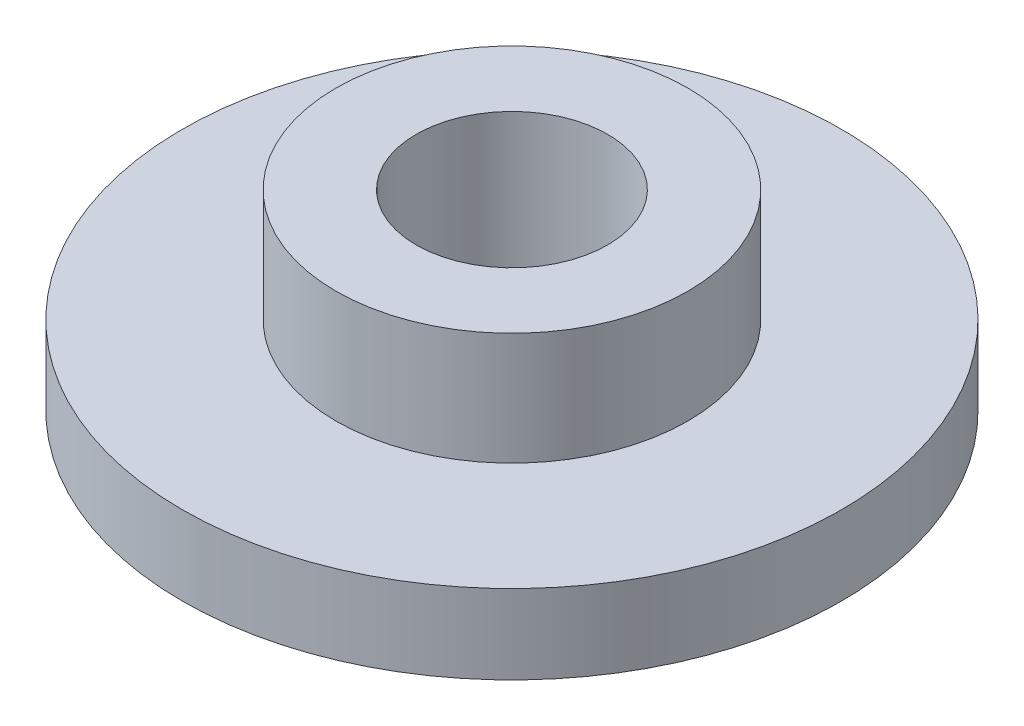
ISO-10303-21;
HEADER;
FILE_DESCRIPTION(('STEP AP214'),'2;1');
FILE_NAME('part.step','',(''),(''),'','','');
FILE_SCHEMA(('AUTOMOTIVE_DESIGN { 1 0 10303 214 1 1 1 1 }'));
ENDSEC;
DATA;
#1=APPLICATION_CONTEXT('core data for automotive mechanical design processes');
#2=APPLICATION_PROTOCOL_DEFINITION('international standard','automotive_design',2000,#1);
#3=PRODUCT_CONTEXT('',#1,'mechanical');
#4=PRODUCT('Part','Part','',(#3));
#5=PRODUCT_RELATED_PRODUCT_CATEGORY('part','',(#4));
#6=PRODUCT_DEFINITION_FORMATION('','',#4);
#7=PRODUCT_DEFINITION_CONTEXT('part definition',#1,'design');
#8=PRODUCT_DEFINITION('design','',#6,#7);
#9=PRODUCT_DEFINITION_SHAPE('','',#8);
#10=(LENGTH_UNIT() NAMED_UNIT(*) SI_UNIT(.MILLI.,.METRE.));
#11=(NAMED_UNIT(*) PLANE_ANGLE_UNIT() SI_UNIT($,.RADIAN.));
#12=(NAMED_UNIT(*) SI_UNIT($,.STERADIAN.) SOLID_ANGLE_UNIT());
#13=UNCERTAINTY_MEASURE_WITH_UNIT(LENGTH_MEASURE(1.E-05),#10,'distance_accuracy_value','');
#14=(GEOMETRIC_REPRESENTATION_CONTEXT(3) GLOBAL_UNCERTAINTY_ASSIGNED_CONTEXT((#13)) GLOBAL_UNIT_ASSIGNED_CONTEXT((#10,
#11,#12)) REPRESENTATION_CONTEXT('',''));
#15=CARTESIAN_POINT('',(0.,0.,0.));
#16=DIRECTION('',(0.,0.,1.));
#17=DIRECTION('',(1.,0.,0.));
#18=AXIS2_PLACEMENT_3D('',#15,#16,#17);
#19=CARTESIAN_POINT('',(0.,0.,0.));
#20=DIRECTION('',(0.,1.,0.));
#21=DIRECTION('',(0.,0.,1.));
#22=AXIS2_PLACEMENT_3D('',#19,#20,#21);
#23=CYLINDRICAL_SURFACE('',#22,4.);
#24=CARTESIAN_POINT('',(0.,8.,0.));
#25=DIRECTION('',(0.,1.,0.));
#26=DIRECTION('',(0.,0.,1.));
#27=AXIS2_PLACEMENT_3D('',#24,#25,#26);
#28=CIRCLE('',#27,4.);
#29=CARTESIAN_POINT('',(0.,8.,4.));
#30=VERTEX_POINT('',#29);
#31=EDGE_CURVE('E10',#30,#30,#28,.T.);
#32=ORIENTED_EDGE('',*,*,#31,.T.);
#33=EDGE_LOOP('',(#32));
#34=FACE_BOUND('',#33,.T.);
#35=CARTESIAN_POINT('',(0.,0.,0.));
#36=DIRECTION('',(0.,1.,0.));
#37=DIRECTION('',(0.,0.,1.));
#38=AXIS2_PLACEMENT_3D('',#35,#36,#37);
#39=CIRCLE('',#38,4.);
#40=CARTESIAN_POINT('',(0.,0.,4.));
#41=VERTEX_POINT('',#40);
#42=EDGE_CURVE('E64',#41,#41,#39,.T.);
#43=ORIENTED_EDGE('',*,*,#42,.F.);
#44=EDGE_LOOP('',(#43));
#45=FACE_BOUND('',#44,.T.);
#46=ADVANCED_FACE('F37',(#34,#45),#23,.F.);
#47=CARTESIAN_POINT('',(-4.,8.,0.));
#48=DIRECTION('',(0.,1.,0.));
#49=DIRECTION('',(0.,0.,1.));
#50=AXIS2_PLACEMENT_3D('',#47,#48,#49);
#51=PLANE('',#50);
#52=CARTESIAN_POINT('',(0.,8.,0.));
#53=DIRECTION('',(0.,1.,0.));
#54=DIRECTION('',(0.,0.,1.));
#55=AXIS2_PLACEMENT_3D('',#52,#53,#54);
#56=CIRCLE('',#55,7.34637867356438);
#57=CARTESIAN_POINT('',(0.,8.,7.34637867356438));
#58=VERTEX_POINT('',#57);
#59=EDGE_CURVE('E44',#58,#58,#56,.T.);
#60=ORIENTED_EDGE('',*,*,#59,.T.);
#61=EDGE_LOOP('',(#60));
#62=FACE_BOUND('',#61,.T.);
#63=ORIENTED_EDGE('',*,*,#31,.F.);
#64=EDGE_LOOP('',(#63));
#65=FACE_BOUND('',#64,.T.);
#66=ADVANCED_FACE('F73',(#62,#65),#51,.T.);
#67=CARTESIAN_POINT('',(0.,0.,0.));
#68=DIRECTION('',(0.,1.,0.));
#69=DIRECTION('',(0.,0.,1.));
#70=AXIS2_PLACEMENT_3D('',#67,#68,#69);
#71=CYLINDRICAL_SURFACE('',#70,7.34637867356438);
#72=CARTESIAN_POINT('',(0.,3.30453955227927,0.));
#73=DIRECTION('',(0.,1.,0.));
#74=DIRECTION('',(0.,0.,1.));
#75=AXIS2_PLACEMENT_3D('',#72,#73,#74);
#76=CIRCLE('',#75,7.34637867356438);
#77=CARTESIAN_POINT('',(0.,3.30453955227927,7.34637867356438));
#78=VERTEX_POINT('',#77);
#79=EDGE_CURVE('E49',#78,#78,#76,.T.);
#80=ORIENTED_EDGE('',*,*,#79,.T.);
#81=EDGE_LOOP('',(#80));
#82=FACE_BOUND('',#81,.T.);
#83=ORIENTED_EDGE('',*,*,#59,.F.);
#84=EDGE_LOOP('',(#83));
#85=FACE_BOUND('',#84,.T.);
#86=ADVANCED_FACE('F77',(#82,#85),#71,.T.);
#87=CARTESIAN_POINT('',(-13.7594166261057,3.30453955227927,0.));
#88=DIRECTION('',(0.,1.,0.));
#89=DIRECTION('',(0.,0.,1.));
#90=AXIS2_PLACEMENT_3D('',#87,#88,#89);
#91=PLANE('',#90);
#92=CARTESIAN_POINT('',(0.,3.30453955227927,0.));
#93=DIRECTION('',(0.,1.,0.));
#94=DIRECTION('',(0.,0.,1.));
#95=AXIS2_PLACEMENT_3D('',#92,#93,#94);
#96=CIRCLE('',#95,13.7594166261057);
#97=CARTESIAN_POINT('',(0.,3.30453955227927,13.7594166261057));
#98=VERTEX_POINT('',#97);
#99=EDGE_CURVE('E54',#98,#98,#96,.T.);
#100=ORIENTED_EDGE('',*,*,#99,.T.);
#101=EDGE_LOOP('',(#100));
#102=FACE_BOUND('',#101,.T.);
#103=ORIENTED_EDGE('',*,*,#79,.F.);
#104=EDGE_LOOP('',(#103));
#105=FACE_BOUND('',#104,.T.);
#106=ADVANCED_FACE('F81',(#102,#105),#91,.T.);
#107=CARTESIAN_POINT('',(0.,0.,0.));
#108=DIRECTION('',(0.,1.,0.));
#109=DIRECTION('',(0.,0.,1.));
#110=AXIS2_PLACEMENT_3D('',#107,#108,#109);
#111=CYLINDRICAL_SURFACE('',#110,13.7594166261057);
#112=CARTESIAN_POINT('',(0.,0.,0.));
#113=DIRECTION('',(0.,1.,0.));
#114=DIRECTION('',(0.,0.,1.));
#115=AXIS2_PLACEMENT_3D('',#112,#113,#114);
#116=CIRCLE('',#115,13.7594166261057);
#117=CARTESIAN_POINT('',(0.,0.,13.7594166261057));
#118=VERTEX_POINT('',#117);
#119=EDGE_CURVE('E60',#118,#118,#116,.T.);
#120=ORIENTED_EDGE('',*,*,#119,.T.);
#121=EDGE_LOOP('',(#120));
#122=FACE_BOUND('',#121,.T.);
#123=ORIENTED_EDGE('',*,*,#99,.F.);
#124=EDGE_LOOP('',(#123));
#125=FACE_BOUND('',#124,.T.);
#126=ADVANCED_FACE('F88',(#122,#125),#111,.T.);
#127=CARTESIAN_POINT('',(-13.7594166261057,0.,0.));
#128=DIRECTION('',(0.,-1.,0.));
#129=DIRECTION('',(0.,0.,-1.));
#130=AXIS2_PLACEMENT_3D('',#127,#128,#129);
#131=PLANE('',#130);
#132=ORIENTED_EDGE('',*,*,#42,.T.);
#133=EDGE_LOOP('',(#132));
#134=FACE_BOUND('',#133,.T.);
#135=ORIENTED_EDGE('',*,*,#119,.F.);
#136=EDGE_LOOP('',(#135));
#137=FACE_BOUND('',#136,.T.);
#138=ADVANCED_FACE('F69',(#134,#137),#131,.T.);
#139=CLOSED_SHELL('',(#46,#66,#86,#106,#126,#138));
#140=MANIFOLD_SOLID_BREP('B2',#139);
#141=ADVANCED_BREP_SHAPE_REPRESENTATION('',(#18,#140),#14);
#142=SHAPE_DEFINITION_REPRESENTATION(#9,#141);
ENDSEC;
END-ISO-10303-21;
